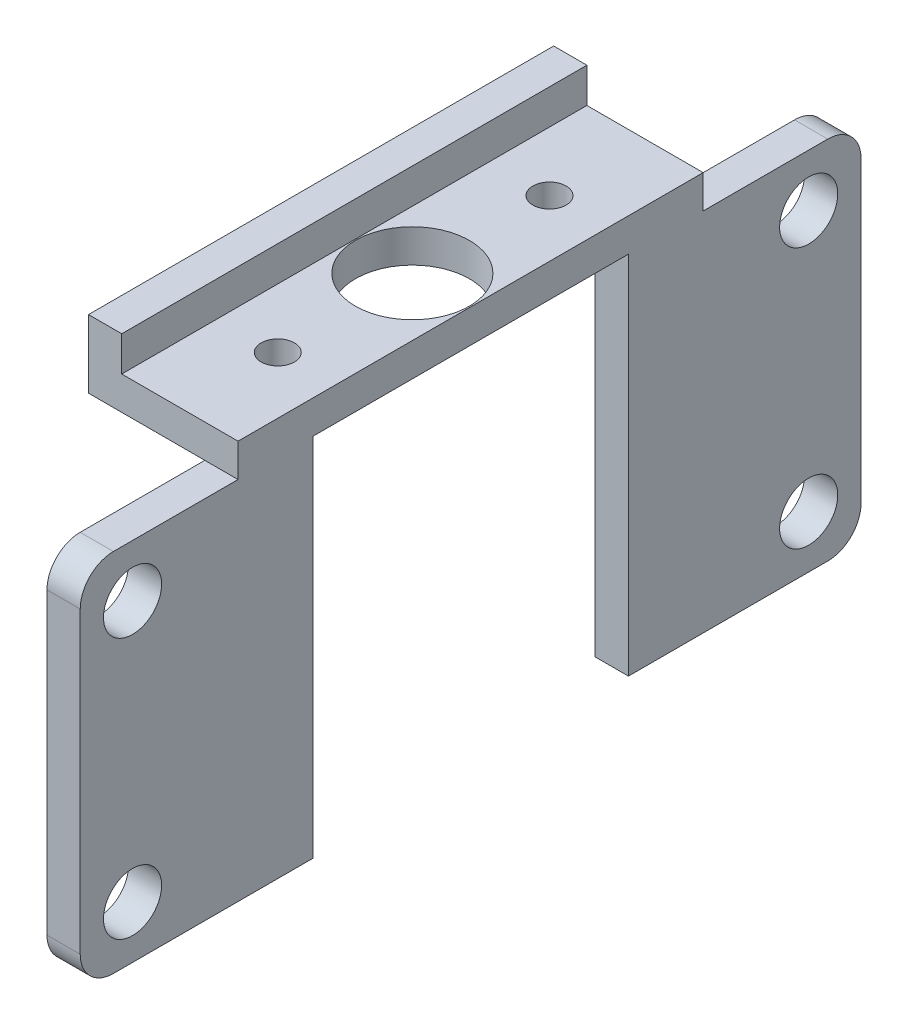
ISO-10303-21;
HEADER;
FILE_DESCRIPTION(('STEP AP214'),'2;1');
FILE_NAME('part.step','',(''),(''),'','','');
FILE_SCHEMA(('AUTOMOTIVE_DESIGN { 1 0 10303 214 1 1 1 1 }'));
ENDSEC;
DATA;
#1=APPLICATION_CONTEXT('core data for automotive mechanical design processes');
#2=APPLICATION_PROTOCOL_DEFINITION('international standard','automotive_design',2000,#1);
#3=PRODUCT_CONTEXT('',#1,'mechanical');
#4=PRODUCT('Part','Part','',(#3));
#5=PRODUCT_RELATED_PRODUCT_CATEGORY('part','',(#4));
#6=PRODUCT_DEFINITION_FORMATION('','',#4);
#7=PRODUCT_DEFINITION_CONTEXT('part definition',#1,'design');
#8=PRODUCT_DEFINITION('design','',#6,#7);
#9=PRODUCT_DEFINITION_SHAPE('','',#8);
#10=(LENGTH_UNIT() NAMED_UNIT(*) SI_UNIT(.MILLI.,.METRE.));
#11=(NAMED_UNIT(*) PLANE_ANGLE_UNIT() SI_UNIT($,.RADIAN.));
#12=(NAMED_UNIT(*) SI_UNIT($,.STERADIAN.) SOLID_ANGLE_UNIT());
#13=UNCERTAINTY_MEASURE_WITH_UNIT(LENGTH_MEASURE(1.E-05),#10,'distance_accuracy_value','');
#14=(GEOMETRIC_REPRESENTATION_CONTEXT(3) GLOBAL_UNCERTAINTY_ASSIGNED_CONTEXT((#13)) GLOBAL_UNIT_ASSIGNED_CONTEXT((#10,
#11,#12)) REPRESENTATION_CONTEXT('',''));
#15=CARTESIAN_POINT('',(0.,0.,0.));
#16=DIRECTION('',(0.,0.,1.));
#17=DIRECTION('',(1.,0.,0.));
#18=AXIS2_PLACEMENT_3D('',#15,#16,#17);
#19=CARTESIAN_POINT('',(-9.95317530410805,-19.4125,28.));
#20=DIRECTION('',(1.,0.,0.));
#21=DIRECTION('',(0.,1.,0.));
#22=AXIS2_PLACEMENT_3D('',#19,#20,#21);
#23=PLANE('',#22);
#24=CARTESIAN_POINT('',(-9.95317530410806,-0.562500000000015,34.35));
#25=DIRECTION('',(-1.,0.,0.));
#26=DIRECTION('',(0.,-1.,0.));
#27=AXIS2_PLACEMENT_3D('',#24,#25,#26);
#28=CIRCLE('',#27,1.75000000000084);
#29=CARTESIAN_POINT('',(-9.95317530410806,-2.31250000000085,34.35));
#30=VERTEX_POINT('',#29);
#31=EDGE_CURVE('E333',#30,#30,#28,.T.);
#32=ORIENTED_EDGE('',*,*,#31,.F.);
#33=EDGE_LOOP('',(#32));
#34=FACE_BOUND('',#33,.T.);
#35=CARTESIAN_POINT('',(-9.95317530410805,-16.2625,34.35));
#36=DIRECTION('',(-1.,0.,0.));
#37=DIRECTION('',(0.,-1.,0.));
#38=AXIS2_PLACEMENT_3D('',#35,#36,#37);
#39=CIRCLE('',#38,1.75000000000083);
#40=CARTESIAN_POINT('',(-9.95317530410805,-18.0125000000008,34.35));
#41=VERTEX_POINT('',#40);
#42=EDGE_CURVE('E458',#41,#41,#39,.T.);
#43=ORIENTED_EDGE('',*,*,#42,.F.);
#44=EDGE_LOOP('',(#43));
#45=FACE_BOUND('',#44,.T.);
#46=DIRECTION('',(0.,0.,-1.));
#47=VECTOR('',#46,1.);
#48=CARTESIAN_POINT('',(-9.95317530410806,2.5875,28.));
#49=LINE('',#48,#47);
#50=CARTESIAN_POINT('',(-9.95317530410806,2.5875,28.));
#51=VERTEX_POINT('',#50);
#52=CARTESIAN_POINT('',(-9.95317530410806,2.5875,23.5));
#53=VERTEX_POINT('',#52);
#54=EDGE_CURVE('E185',#51,#53,#49,.T.);
#55=ORIENTED_EDGE('',*,*,#54,.T.);
#56=DIRECTION('',(0.,1.,0.));
#57=VECTOR('',#56,1.);
#58=CARTESIAN_POINT('',(-9.95317530410805,-19.4125,23.5));
#59=LINE('',#58,#57);
#60=CARTESIAN_POINT('',(-9.95317530410805,-19.4125,23.5));
#61=VERTEX_POINT('',#60);
#62=EDGE_CURVE('E169',#61,#53,#59,.T.);
#63=ORIENTED_EDGE('',*,*,#62,.F.);
#64=DIRECTION('',(0.,0.,-1.));
#65=VECTOR('',#64,1.);
#66=CARTESIAN_POINT('',(-9.95317530410805,-19.4125,28.));
#67=LINE('',#66,#65);
#68=CARTESIAN_POINT('',(-9.95317530410805,-19.4125,35.5));
#69=VERTEX_POINT('',#68);
#70=EDGE_CURVE('E182',#69,#61,#67,.T.);
#71=ORIENTED_EDGE('',*,*,#70,.F.);
#72=CARTESIAN_POINT('',(-9.95317530410805,-17.4125,35.5));
#73=DIRECTION('',(1.,0.,0.));
#74=DIRECTION('',(0.,1.,0.));
#75=AXIS2_PLACEMENT_3D('',#72,#73,#74);
#76=CIRCLE('',#75,2.);
#77=CARTESIAN_POINT('',(-9.95317530410806,-17.4125,37.5));
#78=VERTEX_POINT('',#77);
#79=EDGE_CURVE('E238',#69,#78,#76,.F.);
#80=ORIENTED_EDGE('',*,*,#79,.T.);
#81=DIRECTION('',(0.,-1.,0.));
#82=VECTOR('',#81,1.);
#83=CARTESIAN_POINT('',(-9.95317530410806,-19.4125,37.5));
#84=LINE('',#83,#82);
#85=CARTESIAN_POINT('',(-9.95317530410806,0.587500000000001,37.5));
#86=VERTEX_POINT('',#85);
#87=EDGE_CURVE('E330',#86,#78,#84,.T.);
#88=ORIENTED_EDGE('',*,*,#87,.F.);
#89=CARTESIAN_POINT('',(-9.95317530410806,0.587500000000002,35.5));
#90=DIRECTION('',(1.,0.,0.));
#91=DIRECTION('',(0.,1.,0.));
#92=AXIS2_PLACEMENT_3D('',#89,#90,#91);
#93=CIRCLE('',#92,2.);
#94=CARTESIAN_POINT('',(-9.95317530410806,2.5875,35.5));
#95=VERTEX_POINT('',#94);
#96=EDGE_CURVE('E394',#86,#95,#93,.F.);
#97=ORIENTED_EDGE('',*,*,#96,.T.);
#98=DIRECTION('',(0.,0.,-1.));
#99=VECTOR('',#98,1.);
#100=CARTESIAN_POINT('',(-9.95317530410806,2.5875,37.5));
#101=LINE('',#100,#99);
#102=EDGE_CURVE('E324',#95,#51,#101,.T.);
#103=ORIENTED_EDGE('',*,*,#102,.T.);
#104=EDGE_LOOP('',(#55,#63,#71,#80,#88,#97,#103));
#105=FACE_BOUND('',#104,.T.);
#106=ADVANCED_FACE('F34',(#34,#45,#105),#23,.F.);
#107=CARTESIAN_POINT('',(-7.95317530410805,-19.4125,28.));
#108=DIRECTION('',(0.,1.,0.));
#109=DIRECTION('',(0.,0.,1.));
#110=AXIS2_PLACEMENT_3D('',#107,#108,#109);
#111=PLANE('',#110);
#112=ORIENTED_EDGE('',*,*,#70,.T.);
#113=DIRECTION('',(1.,0.,0.));
#114=VECTOR('',#113,1.);
#115=CARTESIAN_POINT('',(-16.9541753041081,-19.4125,23.5));
#116=LINE('',#115,#114);
#117=CARTESIAN_POINT('',(-7.95317530410805,-19.4125,23.5));
#118=VERTEX_POINT('',#117);
#119=EDGE_CURVE('E166',#61,#118,#116,.T.);
#120=ORIENTED_EDGE('',*,*,#119,.T.);
#121=DIRECTION('',(0.,0.,-1.));
#122=VECTOR('',#121,1.);
#123=CARTESIAN_POINT('',(-7.95317530410805,-19.4125,28.));
#124=LINE('',#123,#122);
#125=CARTESIAN_POINT('',(-7.95317530410805,-19.4125,35.5));
#126=VERTEX_POINT('',#125);
#127=EDGE_CURVE('E194',#126,#118,#124,.T.);
#128=ORIENTED_EDGE('',*,*,#127,.F.);
#129=DIRECTION('',(1.,0.,0.));
#130=VECTOR('',#129,1.);
#131=CARTESIAN_POINT('',(-9.95317530410806,-19.4125,35.5));
#132=LINE('',#131,#130);
#133=EDGE_CURVE('E189',#126,#69,#132,.F.);
#134=ORIENTED_EDGE('',*,*,#133,.T.);
#135=EDGE_LOOP('',(#112,#120,#128,#134));
#136=FACE_BOUND('',#135,.T.);
#137=ADVANCED_FACE('F188',(#136),#111,.F.);
#138=CARTESIAN_POINT('',(0.,0.,28.));
#139=DIRECTION('',(0.,0.,-1.));
#140=DIRECTION('',(-1.,0.,0.));
#141=AXIS2_PLACEMENT_3D('',#138,#139,#140);
#142=PLANE('',#141);
#143=DIRECTION('',(-1.,0.,0.));
#144=VECTOR('',#143,1.);
#145=CARTESIAN_POINT('',(-7.95317530410805,2.5875,28.));
#146=LINE('',#145,#144);
#147=CARTESIAN_POINT('',(-7.95317530410806,2.5875,28.));
#148=VERTEX_POINT('',#147);
#149=EDGE_CURVE('E285',#148,#51,#146,.T.);
#150=ORIENTED_EDGE('',*,*,#149,.F.);
#151=DIRECTION('',(0.,1.,0.));
#152=VECTOR('',#151,1.);
#153=CARTESIAN_POINT('',(-7.95317530410806,4.5875,28.));
#154=LINE('',#153,#152);
#155=CARTESIAN_POINT('',(-7.95317530410806,4.5875,28.));
#156=VERTEX_POINT('',#155);
#157=EDGE_CURVE('E280',#148,#156,#154,.T.);
#158=ORIENTED_EDGE('',*,*,#157,.T.);
#159=DIRECTION('',(-1.,0.,0.));
#160=VECTOR('',#159,1.);
#161=CARTESIAN_POINT('',(-14.9531753041081,4.5875,28.));
#162=LINE('',#161,#160);
#163=CARTESIAN_POINT('',(-14.9531753041081,4.5875,28.));
#164=VERTEX_POINT('',#163);
#165=EDGE_CURVE('E283',#156,#164,#162,.T.);
#166=ORIENTED_EDGE('',*,*,#165,.T.);
#167=DIRECTION('',(0.,1.,0.));
#168=VECTOR('',#167,1.);
#169=CARTESIAN_POINT('',(-14.9531753041081,6.6875,28.));
#170=LINE('',#169,#168);
#171=CARTESIAN_POINT('',(-14.9531753041081,6.6875,28.));
#172=VERTEX_POINT('',#171);
#173=EDGE_CURVE('E292',#164,#172,#170,.T.);
#174=ORIENTED_EDGE('',*,*,#173,.T.);
#175=DIRECTION('',(-1.,0.,0.));
#176=VECTOR('',#175,1.);
#177=CARTESIAN_POINT('',(-16.9531753041081,6.6875,28.));
#178=LINE('',#177,#176);
#179=CARTESIAN_POINT('',(-16.9531753041081,6.6875,28.));
#180=VERTEX_POINT('',#179);
#181=EDGE_CURVE('E224',#172,#180,#178,.T.);
#182=ORIENTED_EDGE('',*,*,#181,.T.);
#183=DIRECTION('',(0.,-1.,0.));
#184=VECTOR('',#183,1.);
#185=CARTESIAN_POINT('',(-16.9531753041081,2.5875,28.));
#186=LINE('',#185,#184);
#187=CARTESIAN_POINT('',(-16.9531753041081,2.5875,28.));
#188=VERTEX_POINT('',#187);
#189=EDGE_CURVE('E219',#180,#188,#186,.T.);
#190=ORIENTED_EDGE('',*,*,#189,.T.);
#191=DIRECTION('',(1.,0.,0.));
#192=VECTOR('',#191,1.);
#193=CARTESIAN_POINT('',(-9.95317530410806,2.5875,28.));
#194=LINE('',#193,#192);
#195=EDGE_CURVE('E284',#188,#51,#194,.T.);
#196=ORIENTED_EDGE('',*,*,#195,.T.);
#197=EDGE_LOOP('',(#150,#158,#166,#174,#182,#190,#196));
#198=FACE_BOUND('',#197,.T.);
#199=ADVANCED_FACE('F318',(#198),#142,.F.);
#200=CARTESIAN_POINT('',(-16.9531753041081,2.5875,28.));
#201=DIRECTION('',(1.,0.,0.));
#202=DIRECTION('',(0.,0.,-1.));
#203=AXIS2_PLACEMENT_3D('',#200,#201,#202);
#204=PLANE('',#203);
#205=DIRECTION('',(0.,-1.,0.));
#206=VECTOR('',#205,1.);
#207=CARTESIAN_POINT('',(-16.9531753041081,2.5875,0.));
#208=LINE('',#207,#206);
#209=CARTESIAN_POINT('',(-16.9531753041081,6.6875,0.));
#210=VERTEX_POINT('',#209);
#211=CARTESIAN_POINT('',(-16.9531753041081,2.5875,0.));
#212=VERTEX_POINT('',#211);
#213=EDGE_CURVE('E294',#210,#212,#208,.T.);
#214=ORIENTED_EDGE('',*,*,#213,.T.);
#215=DIRECTION('',(0.,0.,-1.));
#216=VECTOR('',#215,1.);
#217=CARTESIAN_POINT('',(-16.9531753041081,2.5875,28.));
#218=LINE('',#217,#216);
#219=EDGE_CURVE('E198',#188,#212,#218,.T.);
#220=ORIENTED_EDGE('',*,*,#219,.F.);
#221=ORIENTED_EDGE('',*,*,#189,.F.);
#222=DIRECTION('',(0.,0.,-1.));
#223=VECTOR('',#222,1.);
#224=CARTESIAN_POINT('',(-16.9531753041081,6.6875,28.));
#225=LINE('',#224,#223);
#226=EDGE_CURVE('E220',#180,#210,#225,.T.);
#227=ORIENTED_EDGE('',*,*,#226,.T.);
#228=EDGE_LOOP('',(#214,#220,#221,#227));
#229=FACE_BOUND('',#228,.T.);
#230=ADVANCED_FACE('F383',(#229),#204,.F.);
#231=CARTESIAN_POINT('',(-9.95317530410806,2.5875,28.));
#232=DIRECTION('',(0.,1.,0.));
#233=DIRECTION('',(-1.,0.,0.));
#234=AXIS2_PLACEMENT_3D('',#231,#232,#233);
#235=PLANE('',#234);
#236=CARTESIAN_POINT('',(-9.95317530410806,2.5875,4.5));
#237=VERTEX_POINT('',#236);
#238=CARTESIAN_POINT('',(-9.95317530410806,2.5875,0.));
#239=VERTEX_POINT('',#238);
#240=EDGE_CURVE('E190',#237,#239,#49,.T.);
#241=ORIENTED_EDGE('',*,*,#240,.F.);
#242=DIRECTION('',(1.,0.,0.));
#243=VECTOR('',#242,1.);
#244=CARTESIAN_POINT('',(-16.9541753041081,2.5875,4.5));
#245=LINE('',#244,#243);
#246=CARTESIAN_POINT('',(-7.95317530410806,2.5875,4.5));
#247=VERTEX_POINT('',#246);
#248=EDGE_CURVE('E452',#237,#247,#245,.T.);
#249=ORIENTED_EDGE('',*,*,#248,.T.);
#250=DIRECTION('',(0.,0.,1.));
#251=VECTOR('',#250,1.);
#252=CARTESIAN_POINT('',(-7.95317530410806,2.5875,23.5));
#253=LINE('',#252,#251);
#254=CARTESIAN_POINT('',(-7.95317530410806,2.5875,23.5));
#255=VERTEX_POINT('',#254);
#256=EDGE_CURVE('E178',#247,#255,#253,.T.);
#257=ORIENTED_EDGE('',*,*,#256,.T.);
#258=DIRECTION('',(1.,0.,0.));
#259=VECTOR('',#258,1.);
#260=CARTESIAN_POINT('',(-16.9541753041081,2.5875,23.5));
#261=LINE('',#260,#259);
#262=EDGE_CURVE('E454',#53,#255,#261,.T.);
#263=ORIENTED_EDGE('',*,*,#262,.F.);
#264=ORIENTED_EDGE('',*,*,#54,.F.);
#265=ORIENTED_EDGE('',*,*,#195,.F.);
#266=ORIENTED_EDGE('',*,*,#219,.T.);
#267=DIRECTION('',(1.,0.,0.));
#268=VECTOR('',#267,1.);
#269=CARTESIAN_POINT('',(-9.95317530410806,2.5875,0.));
#270=LINE('',#269,#268);
#271=EDGE_CURVE('E206',#212,#239,#270,.T.);
#272=ORIENTED_EDGE('',*,*,#271,.T.);
#273=EDGE_LOOP('',(#241,#249,#257,#263,#264,#265,#266,#272));
#274=FACE_BOUND('',#273,.T.);
#275=CARTESIAN_POINT('',(-11.3831753041081,2.5875,22.1776538014229));
#276=DIRECTION('',(0.,1.,0.));
#277=DIRECTION('',(0.,0.,1.));
#278=AXIS2_PLACEMENT_3D('',#275,#276,#277);
#279=CIRCLE('',#278,1.);
#280=CARTESIAN_POINT('',(-11.3831753041081,2.5875,23.1776538014229));
#281=VERTEX_POINT('',#280);
#282=EDGE_CURVE('E350',#281,#281,#279,.T.);
#283=ORIENTED_EDGE('',*,*,#282,.T.);
#284=EDGE_LOOP('',(#283));
#285=FACE_BOUND('',#284,.T.);
#286=CARTESIAN_POINT('',(-11.3831753041081,2.5875,5.822));
#287=DIRECTION('',(0.,1.,0.));
#288=DIRECTION('',(0.,0.,1.));
#289=AXIS2_PLACEMENT_3D('',#286,#287,#288);
#290=CIRCLE('',#289,1.);
#291=CARTESIAN_POINT('',(-11.3831753041081,2.5875,6.822));
#292=VERTEX_POINT('',#291);
#293=EDGE_CURVE('E307',#292,#292,#290,.T.);
#294=ORIENTED_EDGE('',*,*,#293,.T.);
#295=EDGE_LOOP('',(#294));
#296=FACE_BOUND('',#295,.T.);
#297=CARTESIAN_POINT('',(-11.4584235869674,2.5875,14.));
#298=DIRECTION('',(0.,1.,0.));
#299=DIRECTION('',(0.,0.,1.));
#300=AXIS2_PLACEMENT_3D('',#297,#298,#299);
#301=CIRCLE('',#300,3.43);
#302=CARTESIAN_POINT('',(-11.4584235869674,2.5875,17.43));
#303=VERTEX_POINT('',#302);
#304=EDGE_CURVE('E296',#303,#303,#301,.T.);
#305=ORIENTED_EDGE('',*,*,#304,.T.);
#306=EDGE_LOOP('',(#305));
#307=FACE_BOUND('',#306,.T.);
#308=ADVANCED_FACE('F385',(#274,#285,#296,#307),#235,.F.);
#309=CARTESIAN_POINT('',(-9.95317530410805,-16.2625,-6.34999999999999));
#310=DIRECTION('',(-1.,0.,0.));
#311=DIRECTION('',(0.,-1.,0.));
#312=AXIS2_PLACEMENT_3D('',#309,#310,#311);
#313=CIRCLE('',#312,1.75000000000083);
#314=CARTESIAN_POINT('',(-9.95317530410805,-18.0125000000008,-6.34999999999999));
#315=VERTEX_POINT('',#314);
#316=EDGE_CURVE('E442',#315,#315,#313,.T.);
#317=ORIENTED_EDGE('',*,*,#316,.F.);
#318=EDGE_LOOP('',(#317));
#319=FACE_BOUND('',#318,.T.);
#320=CARTESIAN_POINT('',(-9.95317530410806,-0.562500000000001,-6.34999999999999));
#321=DIRECTION('',(-1.,0.,0.));
#322=DIRECTION('',(0.,-1.,0.));
#323=AXIS2_PLACEMENT_3D('',#320,#321,#322);
#324=CIRCLE('',#323,1.75000000000083);
#325=CARTESIAN_POINT('',(-9.95317530410806,-2.31250000000083,-6.34999999999999));
#326=VERTEX_POINT('',#325);
#327=EDGE_CURVE('E446',#326,#326,#324,.T.);
#328=ORIENTED_EDGE('',*,*,#327,.F.);
#329=EDGE_LOOP('',(#328));
#330=FACE_BOUND('',#329,.T.);
#331=CARTESIAN_POINT('',(-9.95317530410805,-19.4125,4.5));
#332=VERTEX_POINT('',#331);
#333=CARTESIAN_POINT('',(-9.95317530410805,-19.4125,-7.5));
#334=VERTEX_POINT('',#333);
#335=EDGE_CURVE('E191',#332,#334,#67,.T.);
#336=ORIENTED_EDGE('',*,*,#335,.F.);
#337=DIRECTION('',(0.,-1.,0.));
#338=VECTOR('',#337,1.);
#339=CARTESIAN_POINT('',(-9.95317530410805,-19.4125,4.5));
#340=LINE('',#339,#338);
#341=EDGE_CURVE('E186',#237,#332,#340,.T.);
#342=ORIENTED_EDGE('',*,*,#341,.F.);
#343=ORIENTED_EDGE('',*,*,#240,.T.);
#344=DIRECTION('',(0.,0.,1.));
#345=VECTOR('',#344,1.);
#346=CARTESIAN_POINT('',(-9.95317530410806,2.5875,-9.5));
#347=LINE('',#346,#345);
#348=CARTESIAN_POINT('',(-9.95317530410806,2.5875,-7.5));
#349=VERTEX_POINT('',#348);
#350=EDGE_CURVE('E276',#349,#239,#347,.T.);
#351=ORIENTED_EDGE('',*,*,#350,.F.);
#352=CARTESIAN_POINT('',(-9.95317530410806,0.587500000000002,-7.5));
#353=DIRECTION('',(1.,0.,0.));
#354=DIRECTION('',(0.,1.,0.));
#355=AXIS2_PLACEMENT_3D('',#352,#353,#354);
#356=CIRCLE('',#355,2.);
#357=CARTESIAN_POINT('',(-9.95317530410806,0.587500000000001,-9.5));
#358=VERTEX_POINT('',#357);
#359=EDGE_CURVE('E265',#349,#358,#356,.F.);
#360=ORIENTED_EDGE('',*,*,#359,.T.);
#361=DIRECTION('',(0.,1.,0.));
#362=VECTOR('',#361,1.);
#363=CARTESIAN_POINT('',(-9.95317530410806,-19.4125,-9.5));
#364=LINE('',#363,#362);
#365=CARTESIAN_POINT('',(-9.95317530410806,-17.4125,-9.5));
#366=VERTEX_POINT('',#365);
#367=EDGE_CURVE('E262',#366,#358,#364,.T.);
#368=ORIENTED_EDGE('',*,*,#367,.F.);
#369=CARTESIAN_POINT('',(-9.95317530410805,-17.4125,-7.5));
#370=DIRECTION('',(1.,0.,0.));
#371=DIRECTION('',(0.,1.,0.));
#372=AXIS2_PLACEMENT_3D('',#369,#370,#371);
#373=CIRCLE('',#372,2.);
#374=EDGE_CURVE('E240',#366,#334,#373,.F.);
#375=ORIENTED_EDGE('',*,*,#374,.T.);
#376=EDGE_LOOP('',(#336,#342,#343,#351,#360,#368,#375));
#377=FACE_BOUND('',#376,.T.);
#378=ADVANCED_FACE('F423',(#319,#330,#377),#23,.F.);
#379=CARTESIAN_POINT('',(-7.95317530410805,-19.4125,4.5));
#380=VERTEX_POINT('',#379);
#381=CARTESIAN_POINT('',(-7.95317530410805,-19.4125,-7.5));
#382=VERTEX_POINT('',#381);
#383=EDGE_CURVE('E56',#380,#382,#124,.T.);
#384=ORIENTED_EDGE('',*,*,#383,.F.);
#385=DIRECTION('',(1.,0.,0.));
#386=VECTOR('',#385,1.);
#387=CARTESIAN_POINT('',(-16.9541753041081,-19.4125,4.5));
#388=LINE('',#387,#386);
#389=EDGE_CURVE('E177',#332,#380,#388,.T.);
#390=ORIENTED_EDGE('',*,*,#389,.F.);
#391=ORIENTED_EDGE('',*,*,#335,.T.);
#392=DIRECTION('',(-1.,0.,0.));
#393=VECTOR('',#392,1.);
#394=CARTESIAN_POINT('',(-7.95317530410805,-19.4125,-7.5));
#395=LINE('',#394,#393);
#396=EDGE_CURVE('E239',#334,#382,#395,.F.);
#397=ORIENTED_EDGE('',*,*,#396,.T.);
#398=EDGE_LOOP('',(#384,#390,#391,#397));
#399=FACE_BOUND('',#398,.T.);
#400=ADVANCED_FACE('F428',(#399),#111,.F.);
#401=CARTESIAN_POINT('',(-7.95317530410806,4.5875,28.));
#402=DIRECTION('',(-1.,0.,0.));
#403=DIRECTION('',(0.,-1.,0.));
#404=AXIS2_PLACEMENT_3D('',#401,#402,#403);
#405=PLANE('',#404);
#406=CARTESIAN_POINT('',(-7.95317530410805,-16.2625,34.35));
#407=DIRECTION('',(-1.,0.,0.));
#408=DIRECTION('',(0.,-1.,0.));
#409=AXIS2_PLACEMENT_3D('',#406,#407,#408);
#410=CIRCLE('',#409,1.75000000000083);
#411=CARTESIAN_POINT('',(-7.95317530410805,-18.0125000000008,34.35));
#412=VERTEX_POINT('',#411);
#413=EDGE_CURVE('E461',#412,#412,#410,.F.);
#414=ORIENTED_EDGE('',*,*,#413,.F.);
#415=EDGE_LOOP('',(#414));
#416=FACE_BOUND('',#415,.T.);
#417=CARTESIAN_POINT('',(-7.95317530410805,-16.2625,-6.34999999999999));
#418=DIRECTION('',(-1.,0.,0.));
#419=DIRECTION('',(0.,-1.,0.));
#420=AXIS2_PLACEMENT_3D('',#417,#418,#419);
#421=CIRCLE('',#420,1.75000000000083);
#422=CARTESIAN_POINT('',(-7.95317530410805,-18.0125000000008,-6.34999999999999));
#423=VERTEX_POINT('',#422);
#424=EDGE_CURVE('E465',#423,#423,#421,.F.);
#425=ORIENTED_EDGE('',*,*,#424,.F.);
#426=EDGE_LOOP('',(#425));
#427=FACE_BOUND('',#426,.T.);
#428=CARTESIAN_POINT('',(-7.95317530410806,-0.562500000000001,-6.34999999999999));
#429=DIRECTION('',(-1.,0.,0.));
#430=DIRECTION('',(0.,-1.,0.));
#431=AXIS2_PLACEMENT_3D('',#428,#429,#430);
#432=CIRCLE('',#431,1.75000000000083);
#433=CARTESIAN_POINT('',(-7.95317530410806,-2.31250000000083,-6.34999999999999));
#434=VERTEX_POINT('',#433);
#435=EDGE_CURVE('E338',#434,#434,#432,.F.);
#436=ORIENTED_EDGE('',*,*,#435,.F.);
#437=EDGE_LOOP('',(#436));
#438=FACE_BOUND('',#437,.T.);
#439=CARTESIAN_POINT('',(-7.95317530410806,-0.562500000000015,34.35));
#440=DIRECTION('',(-1.,0.,0.));
#441=DIRECTION('',(0.,-1.,0.));
#442=AXIS2_PLACEMENT_3D('',#439,#440,#441);
#443=CIRCLE('',#442,1.75000000000084);
#444=CARTESIAN_POINT('',(-7.95317530410806,-2.31250000000085,34.35));
#445=VERTEX_POINT('',#444);
#446=EDGE_CURVE('E329',#445,#445,#443,.F.);
#447=ORIENTED_EDGE('',*,*,#446,.F.);
#448=EDGE_LOOP('',(#447));
#449=FACE_BOUND('',#448,.T.);
#450=ORIENTED_EDGE('',*,*,#127,.T.);
#451=DIRECTION('',(0.,-1.,0.));
#452=VECTOR('',#451,1.);
#453=CARTESIAN_POINT('',(-7.95317530410805,-19.4125,23.5));
#454=LINE('',#453,#452);
#455=EDGE_CURVE('E172',#255,#118,#454,.T.);
#456=ORIENTED_EDGE('',*,*,#455,.F.);
#457=ORIENTED_EDGE('',*,*,#256,.F.);
#458=DIRECTION('',(0.,1.,0.));
#459=VECTOR('',#458,1.);
#460=CARTESIAN_POINT('',(-7.95317530410805,-19.4125,4.5));
#461=LINE('',#460,#459);
#462=EDGE_CURVE('E532',#380,#247,#461,.T.);
#463=ORIENTED_EDGE('',*,*,#462,.F.);
#464=ORIENTED_EDGE('',*,*,#383,.T.);
#465=CARTESIAN_POINT('',(-7.95317530410805,-17.4125,-7.5));
#466=DIRECTION('',(-1.,0.,0.));
#467=DIRECTION('',(0.,-1.,0.));
#468=AXIS2_PLACEMENT_3D('',#465,#466,#467);
#469=CIRCLE('',#468,2.);
#470=CARTESIAN_POINT('',(-7.95317530410805,-17.4125,-9.5));
#471=VERTEX_POINT('',#470);
#472=EDGE_CURVE('E42',#382,#471,#469,.F.);
#473=ORIENTED_EDGE('',*,*,#472,.T.);
#474=DIRECTION('',(0.,-1.,0.));
#475=VECTOR('',#474,1.);
#476=CARTESIAN_POINT('',(-7.95317530410805,-19.4125,-9.5));
#477=LINE('',#476,#475);
#478=CARTESIAN_POINT('',(-7.95317530410805,0.587500000000001,-9.5));
#479=VERTEX_POINT('',#478);
#480=EDGE_CURVE('E250',#479,#471,#477,.T.);
#481=ORIENTED_EDGE('',*,*,#480,.F.);
#482=CARTESIAN_POINT('',(-7.95317530410806,0.587500000000002,-7.5));
#483=DIRECTION('',(-1.,0.,0.));
#484=DIRECTION('',(0.,-1.,0.));
#485=AXIS2_PLACEMENT_3D('',#482,#483,#484);
#486=CIRCLE('',#485,2.);
#487=CARTESIAN_POINT('',(-7.95317530410805,2.5875,-7.5));
#488=VERTEX_POINT('',#487);
#489=EDGE_CURVE('E272',#479,#488,#486,.F.);
#490=ORIENTED_EDGE('',*,*,#489,.T.);
#491=DIRECTION('',(0.,0.,1.));
#492=VECTOR('',#491,1.);
#493=CARTESIAN_POINT('',(-7.95317530410805,2.5875,-9.5));
#494=LINE('',#493,#492);
#495=CARTESIAN_POINT('',(-7.95317530410805,2.5875,0.));
#496=VERTEX_POINT('',#495);
#497=EDGE_CURVE('E274',#488,#496,#494,.T.);
#498=ORIENTED_EDGE('',*,*,#497,.T.);
#499=DIRECTION('',(0.,1.,0.));
#500=VECTOR('',#499,1.);
#501=CARTESIAN_POINT('',(-7.95317530410806,4.5875,0.));
#502=LINE('',#501,#500);
#503=CARTESIAN_POINT('',(-7.95317530410806,4.5875,0.));
#504=VERTEX_POINT('',#503);
#505=EDGE_CURVE('E202',#496,#504,#502,.T.);
#506=ORIENTED_EDGE('',*,*,#505,.T.);
#507=DIRECTION('',(0.,0.,-1.));
#508=VECTOR('',#507,1.);
#509=CARTESIAN_POINT('',(-7.95317530410806,4.5875,28.));
#510=LINE('',#509,#508);
#511=EDGE_CURVE('E229',#156,#504,#510,.T.);
#512=ORIENTED_EDGE('',*,*,#511,.F.);
#513=ORIENTED_EDGE('',*,*,#157,.F.);
#514=DIRECTION('',(0.,0.,-1.));
#515=VECTOR('',#514,1.);
#516=CARTESIAN_POINT('',(-7.95317530410805,2.5875,37.5));
#517=LINE('',#516,#515);
#518=CARTESIAN_POINT('',(-7.95317530410805,2.5875,35.5));
#519=VERTEX_POINT('',#518);
#520=EDGE_CURVE('E327',#519,#148,#517,.T.);
#521=ORIENTED_EDGE('',*,*,#520,.F.);
#522=CARTESIAN_POINT('',(-7.95317530410806,0.587500000000002,35.5));
#523=DIRECTION('',(-1.,0.,0.));
#524=DIRECTION('',(0.,-1.,0.));
#525=AXIS2_PLACEMENT_3D('',#522,#523,#524);
#526=CIRCLE('',#525,2.);
#527=CARTESIAN_POINT('',(-7.95317530410805,0.587500000000001,37.5));
#528=VERTEX_POINT('',#527);
#529=EDGE_CURVE('E403',#519,#528,#526,.F.);
#530=ORIENTED_EDGE('',*,*,#529,.T.);
#531=DIRECTION('',(0.,1.,0.));
#532=VECTOR('',#531,1.);
#533=CARTESIAN_POINT('',(-7.95317530410805,-19.4125,37.5));
#534=LINE('',#533,#532);
#535=CARTESIAN_POINT('',(-7.95317530410805,-17.4125,37.5));
#536=VERTEX_POINT('',#535);
#537=EDGE_CURVE('E328',#536,#528,#534,.T.);
#538=ORIENTED_EDGE('',*,*,#537,.F.);
#539=CARTESIAN_POINT('',(-7.95317530410805,-17.4125,35.5));
#540=DIRECTION('',(-1.,0.,0.));
#541=DIRECTION('',(0.,-1.,0.));
#542=AXIS2_PLACEMENT_3D('',#539,#540,#541);
#543=CIRCLE('',#542,2.);
#544=EDGE_CURVE('E49',#536,#126,#543,.F.);
#545=ORIENTED_EDGE('',*,*,#544,.T.);
#546=EDGE_LOOP('',(#450,#456,#457,#463,#464,#473,#481,#490,#498,#506,#512,#513,#521,#530,#538,#545));
#547=FACE_BOUND('',#546,.T.);
#548=ADVANCED_FACE('F235',(#416,#427,#438,#449,#547),#405,.F.);
#549=CARTESIAN_POINT('',(-14.9531753041081,4.5875,28.));
#550=DIRECTION('',(0.,-1.,0.));
#551=DIRECTION('',(1.,0.,0.));
#552=AXIS2_PLACEMENT_3D('',#549,#550,#551);
#553=PLANE('',#552);
#554=CARTESIAN_POINT('',(-11.3831753041081,4.5875,22.1776538014229));
#555=DIRECTION('',(0.,1.,0.));
#556=DIRECTION('',(0.,0.,1.));
#557=AXIS2_PLACEMENT_3D('',#554,#555,#556);
#558=CIRCLE('',#557,1.);
#559=CARTESIAN_POINT('',(-11.3831753041081,4.5875,23.1776538014229));
#560=VERTEX_POINT('',#559);
#561=EDGE_CURVE('E349',#560,#560,#558,.T.);
#562=ORIENTED_EDGE('',*,*,#561,.F.);
#563=EDGE_LOOP('',(#562));
#564=FACE_BOUND('',#563,.T.);
#565=CARTESIAN_POINT('',(-11.3831753041081,4.5875,5.822));
#566=DIRECTION('',(0.,1.,0.));
#567=DIRECTION('',(0.,0.,1.));
#568=AXIS2_PLACEMENT_3D('',#565,#566,#567);
#569=CIRCLE('',#568,1.);
#570=CARTESIAN_POINT('',(-11.3831753041081,4.5875,6.822));
#571=VERTEX_POINT('',#570);
#572=EDGE_CURVE('E310',#571,#571,#569,.T.);
#573=ORIENTED_EDGE('',*,*,#572,.F.);
#574=EDGE_LOOP('',(#573));
#575=FACE_BOUND('',#574,.T.);
#576=CARTESIAN_POINT('',(-11.4584235869674,4.5875,14.));
#577=DIRECTION('',(0.,1.,0.));
#578=DIRECTION('',(0.,0.,1.));
#579=AXIS2_PLACEMENT_3D('',#576,#577,#578);
#580=CIRCLE('',#579,3.43);
#581=CARTESIAN_POINT('',(-11.4584235869674,4.5875,17.43));
#582=VERTEX_POINT('',#581);
#583=EDGE_CURVE('E302',#582,#582,#580,.T.);
#584=ORIENTED_EDGE('',*,*,#583,.F.);
#585=EDGE_LOOP('',(#584));
#586=FACE_BOUND('',#585,.T.);
#587=DIRECTION('',(-1.,0.,0.));
#588=VECTOR('',#587,1.);
#589=CARTESIAN_POINT('',(-14.9531753041081,4.5875,0.));
#590=LINE('',#589,#588);
#591=CARTESIAN_POINT('',(-14.9531753041081,4.5875,0.));
#592=VERTEX_POINT('',#591);
#593=EDGE_CURVE('E205',#504,#592,#590,.T.);
#594=ORIENTED_EDGE('',*,*,#593,.T.);
#595=DIRECTION('',(0.,0.,-1.));
#596=VECTOR('',#595,1.);
#597=CARTESIAN_POINT('',(-14.9531753041081,4.5875,28.));
#598=LINE('',#597,#596);
#599=EDGE_CURVE('E227',#164,#592,#598,.T.);
#600=ORIENTED_EDGE('',*,*,#599,.F.);
#601=ORIENTED_EDGE('',*,*,#165,.F.);
#602=ORIENTED_EDGE('',*,*,#511,.T.);
#603=EDGE_LOOP('',(#594,#600,#601,#602));
#604=FACE_BOUND('',#603,.T.);
#605=ADVANCED_FACE('F362',(#564,#575,#586,#604),#553,.F.);
#606=CARTESIAN_POINT('',(-14.9531753041081,6.6875,28.));
#607=DIRECTION('',(-1.,0.,0.));
#608=DIRECTION('',(0.,-1.,0.));
#609=AXIS2_PLACEMENT_3D('',#606,#607,#608);
#610=PLANE('',#609);
#611=DIRECTION('',(0.,1.,0.));
#612=VECTOR('',#611,1.);
#613=CARTESIAN_POINT('',(-14.9531753041081,6.6875,0.));
#614=LINE('',#613,#612);
#615=CARTESIAN_POINT('',(-14.9531753041081,6.6875,0.));
#616=VERTEX_POINT('',#615);
#617=EDGE_CURVE('E215',#592,#616,#614,.T.);
#618=ORIENTED_EDGE('',*,*,#617,.T.);
#619=DIRECTION('',(0.,0.,-1.));
#620=VECTOR('',#619,1.);
#621=CARTESIAN_POINT('',(-14.9531753041081,6.6875,28.));
#622=LINE('',#621,#620);
#623=EDGE_CURVE('E223',#172,#616,#622,.T.);
#624=ORIENTED_EDGE('',*,*,#623,.F.);
#625=ORIENTED_EDGE('',*,*,#173,.F.);
#626=ORIENTED_EDGE('',*,*,#599,.T.);
#627=EDGE_LOOP('',(#618,#624,#625,#626));
#628=FACE_BOUND('',#627,.T.);
#629=ADVANCED_FACE('F365',(#628),#610,.F.);
#630=CARTESIAN_POINT('',(-16.9531753041081,6.6875,28.));
#631=DIRECTION('',(0.,-1.,0.));
#632=DIRECTION('',(1.,0.,0.));
#633=AXIS2_PLACEMENT_3D('',#630,#631,#632);
#634=PLANE('',#633);
#635=DIRECTION('',(-1.,0.,0.));
#636=VECTOR('',#635,1.);
#637=CARTESIAN_POINT('',(-16.9531753041081,6.6875,0.));
#638=LINE('',#637,#636);
#639=EDGE_CURVE('E217',#616,#210,#638,.T.);
#640=ORIENTED_EDGE('',*,*,#639,.T.);
#641=ORIENTED_EDGE('',*,*,#226,.F.);
#642=ORIENTED_EDGE('',*,*,#181,.F.);
#643=ORIENTED_EDGE('',*,*,#623,.T.);
#644=EDGE_LOOP('',(#640,#641,#642,#643));
#645=FACE_BOUND('',#644,.T.);
#646=ADVANCED_FACE('F381',(#645),#634,.F.);
#647=CARTESIAN_POINT('',(0.,0.,0.));
#648=DIRECTION('',(0.,0.,-1.));
#649=DIRECTION('',(-1.,0.,0.));
#650=AXIS2_PLACEMENT_3D('',#647,#648,#649);
#651=PLANE('',#650);
#652=DIRECTION('',(1.,0.,0.));
#653=VECTOR('',#652,1.);
#654=CARTESIAN_POINT('',(-7.95317530410805,2.5875,0.));
#655=LINE('',#654,#653);
#656=EDGE_CURVE('E207',#239,#496,#655,.T.);
#657=ORIENTED_EDGE('',*,*,#656,.F.);
#658=ORIENTED_EDGE('',*,*,#271,.F.);
#659=ORIENTED_EDGE('',*,*,#213,.F.);
#660=ORIENTED_EDGE('',*,*,#639,.F.);
#661=ORIENTED_EDGE('',*,*,#617,.F.);
#662=ORIENTED_EDGE('',*,*,#593,.F.);
#663=ORIENTED_EDGE('',*,*,#505,.F.);
#664=EDGE_LOOP('',(#657,#658,#659,#660,#661,#662,#663));
#665=FACE_BOUND('',#664,.T.);
#666=ADVANCED_FACE('F378',(#665),#651,.T.);
#667=CARTESIAN_POINT('',(-11.4584235869674,2.5875,14.));
#668=DIRECTION('',(0.,1.,0.));
#669=DIRECTION('',(0.,0.,1.));
#670=AXIS2_PLACEMENT_3D('',#667,#668,#669);
#671=CYLINDRICAL_SURFACE('',#670,3.43);
#672=ORIENTED_EDGE('',*,*,#304,.F.);
#673=EDGE_LOOP('',(#672));
#674=FACE_BOUND('',#673,.T.);
#675=ORIENTED_EDGE('',*,*,#583,.T.);
#676=EDGE_LOOP('',(#675));
#677=FACE_BOUND('',#676,.T.);
#678=ADVANCED_FACE('F488',(#674,#677),#671,.F.);
#679=CARTESIAN_POINT('',(-11.3831753041081,2.5875,5.822));
#680=DIRECTION('',(0.,1.,0.));
#681=DIRECTION('',(0.,0.,1.));
#682=AXIS2_PLACEMENT_3D('',#679,#680,#681);
#683=CYLINDRICAL_SURFACE('',#682,1.);
#684=ORIENTED_EDGE('',*,*,#293,.F.);
#685=EDGE_LOOP('',(#684));
#686=FACE_BOUND('',#685,.T.);
#687=ORIENTED_EDGE('',*,*,#572,.T.);
#688=EDGE_LOOP('',(#687));
#689=FACE_BOUND('',#688,.T.);
#690=ADVANCED_FACE('F360',(#686,#689),#683,.F.);
#691=CARTESIAN_POINT('',(-11.3831753041081,2.5875,22.1776538014229));
#692=DIRECTION('',(0.,1.,0.));
#693=DIRECTION('',(0.,0.,1.));
#694=AXIS2_PLACEMENT_3D('',#691,#692,#693);
#695=CYLINDRICAL_SURFACE('',#694,1.);
#696=ORIENTED_EDGE('',*,*,#282,.F.);
#697=EDGE_LOOP('',(#696));
#698=FACE_BOUND('',#697,.T.);
#699=ORIENTED_EDGE('',*,*,#561,.T.);
#700=EDGE_LOOP('',(#699));
#701=FACE_BOUND('',#700,.T.);
#702=ADVANCED_FACE('F496',(#698,#701),#695,.F.);
#703=CARTESIAN_POINT('',(-7.95317530410805,2.5875,-9.5));
#704=DIRECTION('',(0.,-1.,0.));
#705=DIRECTION('',(0.,0.,-1.));
#706=AXIS2_PLACEMENT_3D('',#703,#704,#705);
#707=PLANE('',#706);
#708=ORIENTED_EDGE('',*,*,#497,.F.);
#709=DIRECTION('',(1.,0.,0.));
#710=VECTOR('',#709,1.);
#711=CARTESIAN_POINT('',(-7.95317530410805,2.5875,-7.5));
#712=LINE('',#711,#710);
#713=EDGE_CURVE('E268',#488,#349,#712,.F.);
#714=ORIENTED_EDGE('',*,*,#713,.T.);
#715=ORIENTED_EDGE('',*,*,#350,.T.);
#716=ORIENTED_EDGE('',*,*,#656,.T.);
#717=EDGE_LOOP('',(#708,#714,#715,#716));
#718=FACE_BOUND('',#717,.T.);
#719=ADVANCED_FACE('F500',(#718),#707,.F.);
#720=CARTESIAN_POINT('',(0.,0.,-9.5));
#721=DIRECTION('',(0.,0.,1.));
#722=DIRECTION('',(1.,0.,0.));
#723=AXIS2_PLACEMENT_3D('',#720,#721,#722);
#724=PLANE('',#723);
#725=ORIENTED_EDGE('',*,*,#480,.T.);
#726=DIRECTION('',(-1.,0.,0.));
#727=VECTOR('',#726,1.);
#728=CARTESIAN_POINT('',(0.,-17.4125,-9.5));
#729=LINE('',#728,#727);
#730=EDGE_CURVE('E258',#471,#366,#729,.T.);
#731=ORIENTED_EDGE('',*,*,#730,.T.);
#732=ORIENTED_EDGE('',*,*,#367,.T.);
#733=DIRECTION('',(1.,0.,0.));
#734=VECTOR('',#733,1.);
#735=CARTESIAN_POINT('',(0.,0.587500000000002,-9.5));
#736=LINE('',#735,#734);
#737=EDGE_CURVE('E261',#358,#479,#736,.T.);
#738=ORIENTED_EDGE('',*,*,#737,.T.);
#739=EDGE_LOOP('',(#725,#731,#732,#738));
#740=FACE_BOUND('',#739,.T.);
#741=ADVANCED_FACE('F257',(#740),#724,.F.);
#742=CARTESIAN_POINT('',(-7.95317530410805,2.5875,37.5));
#743=DIRECTION('',(0.,-1.,0.));
#744=DIRECTION('',(0.,0.,-1.));
#745=AXIS2_PLACEMENT_3D('',#742,#743,#744);
#746=PLANE('',#745);
#747=ORIENTED_EDGE('',*,*,#102,.F.);
#748=DIRECTION('',(-1.,0.,0.));
#749=VECTOR('',#748,1.);
#750=CARTESIAN_POINT('',(-7.95317530410805,2.5875,35.5));
#751=LINE('',#750,#749);
#752=EDGE_CURVE('E396',#95,#519,#751,.F.);
#753=ORIENTED_EDGE('',*,*,#752,.T.);
#754=ORIENTED_EDGE('',*,*,#520,.T.);
#755=ORIENTED_EDGE('',*,*,#149,.T.);
#756=EDGE_LOOP('',(#747,#753,#754,#755));
#757=FACE_BOUND('',#756,.T.);
#758=ADVANCED_FACE('F323',(#757),#746,.F.);
#759=CARTESIAN_POINT('',(0.,0.,37.5));
#760=DIRECTION('',(0.,0.,1.));
#761=DIRECTION('',(1.,0.,0.));
#762=AXIS2_PLACEMENT_3D('',#759,#760,#761);
#763=PLANE('',#762);
#764=ORIENTED_EDGE('',*,*,#87,.T.);
#765=DIRECTION('',(1.,0.,0.));
#766=VECTOR('',#765,1.);
#767=CARTESIAN_POINT('',(-7.95317530410805,-17.4125,37.5));
#768=LINE('',#767,#766);
#769=EDGE_CURVE('E11',#78,#536,#768,.T.);
#770=ORIENTED_EDGE('',*,*,#769,.T.);
#771=ORIENTED_EDGE('',*,*,#537,.T.);
#772=DIRECTION('',(-1.,0.,0.));
#773=VECTOR('',#772,1.);
#774=CARTESIAN_POINT('',(-9.95317530410806,0.587500000000002,37.5));
#775=LINE('',#774,#773);
#776=EDGE_CURVE('E201',#528,#86,#775,.T.);
#777=ORIENTED_EDGE('',*,*,#776,.T.);
#778=EDGE_LOOP('',(#764,#770,#771,#777));
#779=FACE_BOUND('',#778,.T.);
#780=ADVANCED_FACE('F410',(#779),#763,.T.);
#781=CARTESIAN_POINT('',(0.,0.587500000000002,35.5));
#782=DIRECTION('',(1.,0.,0.));
#783=DIRECTION('',(0.,0.,-1.));
#784=AXIS2_PLACEMENT_3D('',#781,#782,#783);
#785=CYLINDRICAL_SURFACE('',#784,2.);
#786=ORIENTED_EDGE('',*,*,#529,.F.);
#787=ORIENTED_EDGE('',*,*,#752,.F.);
#788=ORIENTED_EDGE('',*,*,#96,.F.);
#789=ORIENTED_EDGE('',*,*,#776,.F.);
#790=EDGE_LOOP('',(#786,#787,#788,#789));
#791=FACE_BOUND('',#790,.T.);
#792=ADVANCED_FACE('F407',(#791),#785,.T.);
#793=CARTESIAN_POINT('',(0.,0.587500000000002,-7.5));
#794=DIRECTION('',(1.,0.,0.));
#795=DIRECTION('',(0.,0.,-1.));
#796=AXIS2_PLACEMENT_3D('',#793,#794,#795);
#797=CYLINDRICAL_SURFACE('',#796,2.);
#798=ORIENTED_EDGE('',*,*,#359,.F.);
#799=ORIENTED_EDGE('',*,*,#713,.F.);
#800=ORIENTED_EDGE('',*,*,#489,.F.);
#801=ORIENTED_EDGE('',*,*,#737,.F.);
#802=EDGE_LOOP('',(#798,#799,#800,#801));
#803=FACE_BOUND('',#802,.T.);
#804=ADVANCED_FACE('F409',(#803),#797,.T.);
#805=CARTESIAN_POINT('',(0.,-17.4125,-7.5));
#806=DIRECTION('',(-1.,0.,0.));
#807=DIRECTION('',(0.,0.,1.));
#808=AXIS2_PLACEMENT_3D('',#805,#806,#807);
#809=CYLINDRICAL_SURFACE('',#808,2.);
#810=ORIENTED_EDGE('',*,*,#472,.F.);
#811=ORIENTED_EDGE('',*,*,#396,.F.);
#812=ORIENTED_EDGE('',*,*,#374,.F.);
#813=ORIENTED_EDGE('',*,*,#730,.F.);
#814=EDGE_LOOP('',(#810,#811,#812,#813));
#815=FACE_BOUND('',#814,.T.);
#816=ADVANCED_FACE('F264',(#815),#809,.T.);
#817=CARTESIAN_POINT('',(0.,-17.4125,35.5));
#818=DIRECTION('',(-1.,0.,0.));
#819=DIRECTION('',(0.,0.,1.));
#820=AXIS2_PLACEMENT_3D('',#817,#818,#819);
#821=CYLINDRICAL_SURFACE('',#820,2.);
#822=ORIENTED_EDGE('',*,*,#79,.F.);
#823=ORIENTED_EDGE('',*,*,#133,.F.);
#824=ORIENTED_EDGE('',*,*,#544,.F.);
#825=ORIENTED_EDGE('',*,*,#769,.F.);
#826=EDGE_LOOP('',(#822,#823,#824,#825));
#827=FACE_BOUND('',#826,.T.);
#828=ADVANCED_FACE('F36',(#827),#821,.T.);
#829=CARTESIAN_POINT('',(-7.95212530410806,-0.562500000000015,34.35));
#830=DIRECTION('',(-1.,0.,0.));
#831=DIRECTION('',(0.,-1.,0.));
#832=AXIS2_PLACEMENT_3D('',#829,#830,#831);
#833=CYLINDRICAL_SURFACE('',#832,1.75000000000084);
#834=ORIENTED_EDGE('',*,*,#31,.T.);
#835=EDGE_LOOP('',(#834));
#836=FACE_BOUND('',#835,.T.);
#837=ORIENTED_EDGE('',*,*,#446,.T.);
#838=EDGE_LOOP('',(#837));
#839=FACE_BOUND('',#838,.T.);
#840=ADVANCED_FACE('F508',(#836,#839),#833,.F.);
#841=CARTESIAN_POINT('',(-7.95212530410806,-0.562500000000001,-6.34999999999999));
#842=DIRECTION('',(-1.,0.,0.));
#843=DIRECTION('',(0.,-1.,0.));
#844=AXIS2_PLACEMENT_3D('',#841,#842,#843);
#845=CYLINDRICAL_SURFACE('',#844,1.75000000000083);
#846=ORIENTED_EDGE('',*,*,#327,.T.);
#847=EDGE_LOOP('',(#846));
#848=FACE_BOUND('',#847,.T.);
#849=ORIENTED_EDGE('',*,*,#435,.T.);
#850=EDGE_LOOP('',(#849));
#851=FACE_BOUND('',#850,.T.);
#852=ADVANCED_FACE('F471',(#848,#851),#845,.F.);
#853=CARTESIAN_POINT('',(-7.95212530410805,-16.2625,-6.34999999999999));
#854=DIRECTION('',(-1.,0.,0.));
#855=DIRECTION('',(0.,-1.,0.));
#856=AXIS2_PLACEMENT_3D('',#853,#854,#855);
#857=CYLINDRICAL_SURFACE('',#856,1.75000000000083);
#858=ORIENTED_EDGE('',*,*,#316,.T.);
#859=EDGE_LOOP('',(#858));
#860=FACE_BOUND('',#859,.T.);
#861=ORIENTED_EDGE('',*,*,#424,.T.);
#862=EDGE_LOOP('',(#861));
#863=FACE_BOUND('',#862,.T.);
#864=ADVANCED_FACE('F514',(#860,#863),#857,.F.);
#865=CARTESIAN_POINT('',(-7.95212530410805,-16.2625,34.35));
#866=DIRECTION('',(-1.,0.,0.));
#867=DIRECTION('',(0.,-1.,0.));
#868=AXIS2_PLACEMENT_3D('',#865,#866,#867);
#869=CYLINDRICAL_SURFACE('',#868,1.75000000000083);
#870=ORIENTED_EDGE('',*,*,#42,.T.);
#871=EDGE_LOOP('',(#870));
#872=FACE_BOUND('',#871,.T.);
#873=ORIENTED_EDGE('',*,*,#413,.T.);
#874=EDGE_LOOP('',(#873));
#875=FACE_BOUND('',#874,.T.);
#876=ADVANCED_FACE('F518',(#872,#875),#869,.F.);
#877=CARTESIAN_POINT('',(-16.9541753041081,-19.4125,23.5));
#878=DIRECTION('',(0.,0.,1.));
#879=DIRECTION('',(1.,0.,0.));
#880=AXIS2_PLACEMENT_3D('',#877,#878,#879);
#881=PLANE('',#880);
#882=ORIENTED_EDGE('',*,*,#62,.T.);
#883=ORIENTED_EDGE('',*,*,#262,.T.);
#884=ORIENTED_EDGE('',*,*,#455,.T.);
#885=ORIENTED_EDGE('',*,*,#119,.F.);
#886=EDGE_LOOP('',(#882,#883,#884,#885));
#887=FACE_BOUND('',#886,.T.);
#888=ADVANCED_FACE('F168',(#887),#881,.F.);
#889=CARTESIAN_POINT('',(-16.9541753041081,-19.4125,4.5));
#890=DIRECTION('',(0.,0.,-1.));
#891=DIRECTION('',(-1.,0.,0.));
#892=AXIS2_PLACEMENT_3D('',#889,#890,#891);
#893=PLANE('',#892);
#894=ORIENTED_EDGE('',*,*,#341,.T.);
#895=ORIENTED_EDGE('',*,*,#389,.T.);
#896=ORIENTED_EDGE('',*,*,#462,.T.);
#897=ORIENTED_EDGE('',*,*,#248,.F.);
#898=EDGE_LOOP('',(#894,#895,#896,#897));
#899=FACE_BOUND('',#898,.T.);
#900=ADVANCED_FACE('F525',(#899),#893,.F.);
#901=CLOSED_SHELL('',(#106,#137,#199,#230,#308,#378,#400,#548,#605,#629,#646,#666,#678,#690,
#702,#719,#741,#758,#780,#792,#804,#816,#828,#840,#852,#864,#876,#888,#900));
#902=MANIFOLD_SOLID_BREP('B2',#901);
#903=ADVANCED_BREP_SHAPE_REPRESENTATION('',(#18,#902),#14);
#904=SHAPE_DEFINITION_REPRESENTATION(#9,#903);
ENDSEC;
END-ISO-10303-21;
